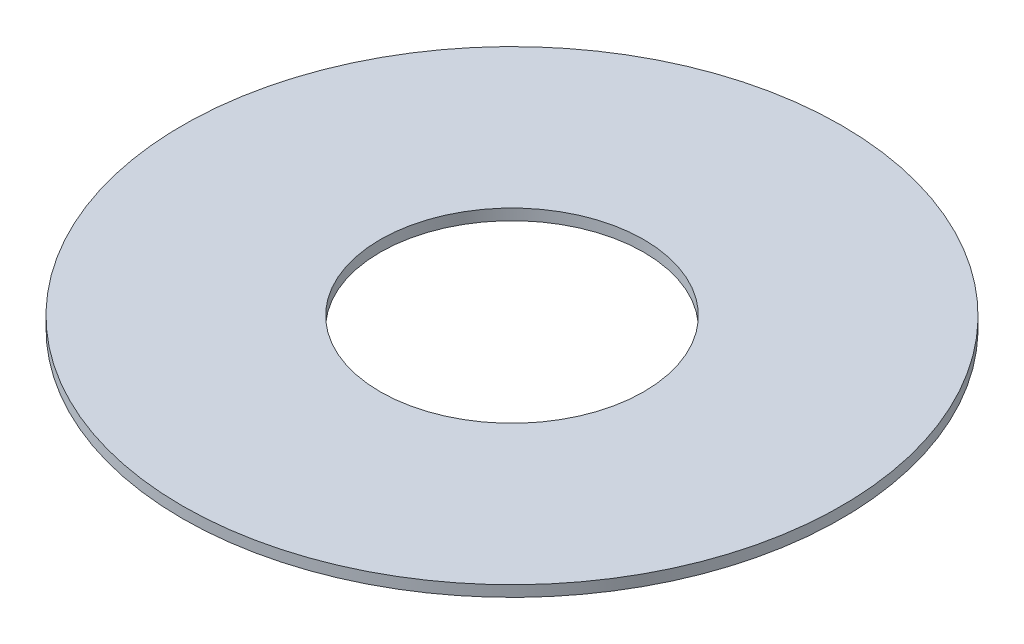
ISO-10303-21;
HEADER;
FILE_DESCRIPTION(('STEP AP214'),'2;1');
FILE_NAME('part.step','',(''),(''),'','','');
FILE_SCHEMA(('AUTOMOTIVE_DESIGN { 1 0 10303 214 1 1 1 1 }'));
ENDSEC;
DATA;
#1=APPLICATION_CONTEXT('core data for automotive mechanical design processes');
#2=APPLICATION_PROTOCOL_DEFINITION('international standard','automotive_design',2000,#1);
#3=PRODUCT_CONTEXT('',#1,'mechanical');
#4=PRODUCT('Part','Part','',(#3));
#5=PRODUCT_RELATED_PRODUCT_CATEGORY('part','',(#4));
#6=PRODUCT_DEFINITION_FORMATION('','',#4);
#7=PRODUCT_DEFINITION_CONTEXT('part definition',#1,'design');
#8=PRODUCT_DEFINITION('design','',#6,#7);
#9=PRODUCT_DEFINITION_SHAPE('','',#8);
#10=(LENGTH_UNIT() NAMED_UNIT(*) SI_UNIT(.MILLI.,.METRE.));
#11=(NAMED_UNIT(*) PLANE_ANGLE_UNIT() SI_UNIT($,.RADIAN.));
#12=(NAMED_UNIT(*) SI_UNIT($,.STERADIAN.) SOLID_ANGLE_UNIT());
#13=UNCERTAINTY_MEASURE_WITH_UNIT(LENGTH_MEASURE(1.E-05),#10,'distance_accuracy_value','');
#14=(GEOMETRIC_REPRESENTATION_CONTEXT(3) GLOBAL_UNCERTAINTY_ASSIGNED_CONTEXT((#13)) GLOBAL_UNIT_ASSIGNED_CONTEXT((#10,
#11,#12)) REPRESENTATION_CONTEXT('',''));
#15=CARTESIAN_POINT('',(0.,0.,0.));
#16=DIRECTION('',(0.,0.,1.));
#17=DIRECTION('',(1.,0.,0.));
#18=AXIS2_PLACEMENT_3D('',#15,#16,#17);
#19=CARTESIAN_POINT('',(0.,0.1,0.));
#20=DIRECTION('',(0.,1.,0.));
#21=DIRECTION('',(0.,0.,1.));
#22=AXIS2_PLACEMENT_3D('',#19,#20,#21);
#23=PLANE('',#22);
#24=CARTESIAN_POINT('',(0.,0.1,0.));
#25=DIRECTION('',(0.,1.,0.));
#26=DIRECTION('',(0.,0.,1.));
#27=AXIS2_PLACEMENT_3D('',#24,#25,#26);
#28=CIRCLE('',#27,3.);
#29=CARTESIAN_POINT('',(0.,0.1,3.));
#30=VERTEX_POINT('',#29);
#31=EDGE_CURVE('E10',#30,#30,#28,.T.);
#32=ORIENTED_EDGE('',*,*,#31,.T.);
#33=EDGE_LOOP('',(#32));
#34=FACE_BOUND('',#33,.T.);
#35=CARTESIAN_POINT('',(0.,0.1,0.));
#36=DIRECTION('',(0.,1.,0.));
#37=DIRECTION('',(0.,0.,1.));
#38=AXIS2_PLACEMENT_3D('',#35,#36,#37);
#39=CIRCLE('',#38,1.2);
#40=CARTESIAN_POINT('',(0.,0.1,1.2));
#41=VERTEX_POINT('',#40);
#42=EDGE_CURVE('E39',#41,#41,#39,.T.);
#43=ORIENTED_EDGE('',*,*,#42,.F.);
#44=EDGE_LOOP('',(#43));
#45=FACE_BOUND('',#44,.T.);
#46=ADVANCED_FACE('F28',(#34,#45),#23,.T.);
#47=CARTESIAN_POINT('',(0.,0.,0.));
#48=DIRECTION('',(0.,1.,0.));
#49=DIRECTION('',(0.,0.,1.));
#50=AXIS2_PLACEMENT_3D('',#47,#48,#49);
#51=PLANE('',#50);
#52=CARTESIAN_POINT('',(0.,0.,0.));
#53=DIRECTION('',(0.,1.,0.));
#54=DIRECTION('',(0.,0.,1.));
#55=AXIS2_PLACEMENT_3D('',#52,#53,#54);
#56=CIRCLE('',#55,3.);
#57=CARTESIAN_POINT('',(0.,0.,3.));
#58=VERTEX_POINT('',#57);
#59=EDGE_CURVE('E35',#58,#58,#56,.T.);
#60=ORIENTED_EDGE('',*,*,#59,.F.);
#61=EDGE_LOOP('',(#60));
#62=FACE_BOUND('',#61,.T.);
#63=CARTESIAN_POINT('',(0.,0.,0.));
#64=DIRECTION('',(0.,1.,0.));
#65=DIRECTION('',(0.,0.,1.));
#66=AXIS2_PLACEMENT_3D('',#63,#64,#65);
#67=CIRCLE('',#66,1.2);
#68=CARTESIAN_POINT('',(0.,0.,1.2));
#69=VERTEX_POINT('',#68);
#70=EDGE_CURVE('E43',#69,#69,#67,.T.);
#71=ORIENTED_EDGE('',*,*,#70,.T.);
#72=EDGE_LOOP('',(#71));
#73=FACE_BOUND('',#72,.T.);
#74=ADVANCED_FACE('F49',(#62,#73),#51,.F.);
#75=CARTESIAN_POINT('',(0.,0.1,0.));
#76=DIRECTION('',(0.,-1.,0.));
#77=DIRECTION('',(0.,0.,-1.));
#78=AXIS2_PLACEMENT_3D('',#75,#76,#77);
#79=CYLINDRICAL_SURFACE('',#78,3.);
#80=ORIENTED_EDGE('',*,*,#31,.F.);
#81=EDGE_LOOP('',(#80));
#82=FACE_BOUND('',#81,.T.);
#83=ORIENTED_EDGE('',*,*,#59,.T.);
#84=EDGE_LOOP('',(#83));
#85=FACE_BOUND('',#84,.T.);
#86=ADVANCED_FACE('F30',(#82,#85),#79,.T.);
#87=CARTESIAN_POINT('',(0.,0.1,0.));
#88=DIRECTION('',(0.,-1.,0.));
#89=DIRECTION('',(0.,0.,-1.));
#90=AXIS2_PLACEMENT_3D('',#87,#88,#89);
#91=CYLINDRICAL_SURFACE('',#90,1.2);
#92=ORIENTED_EDGE('',*,*,#42,.T.);
#93=EDGE_LOOP('',(#92));
#94=FACE_BOUND('',#93,.T.);
#95=ORIENTED_EDGE('',*,*,#70,.F.);
#96=EDGE_LOOP('',(#95));
#97=FACE_BOUND('',#96,.T.);
#98=ADVANCED_FACE('F51',(#94,#97),#91,.F.);
#99=CLOSED_SHELL('',(#46,#74,#86,#98));
#100=MANIFOLD_SOLID_BREP('B2',#99);
#101=ADVANCED_BREP_SHAPE_REPRESENTATION('',(#18,#100),#14);
#102=SHAPE_DEFINITION_REPRESENTATION(#9,#101);
ENDSEC;
END-ISO-10303-21;
